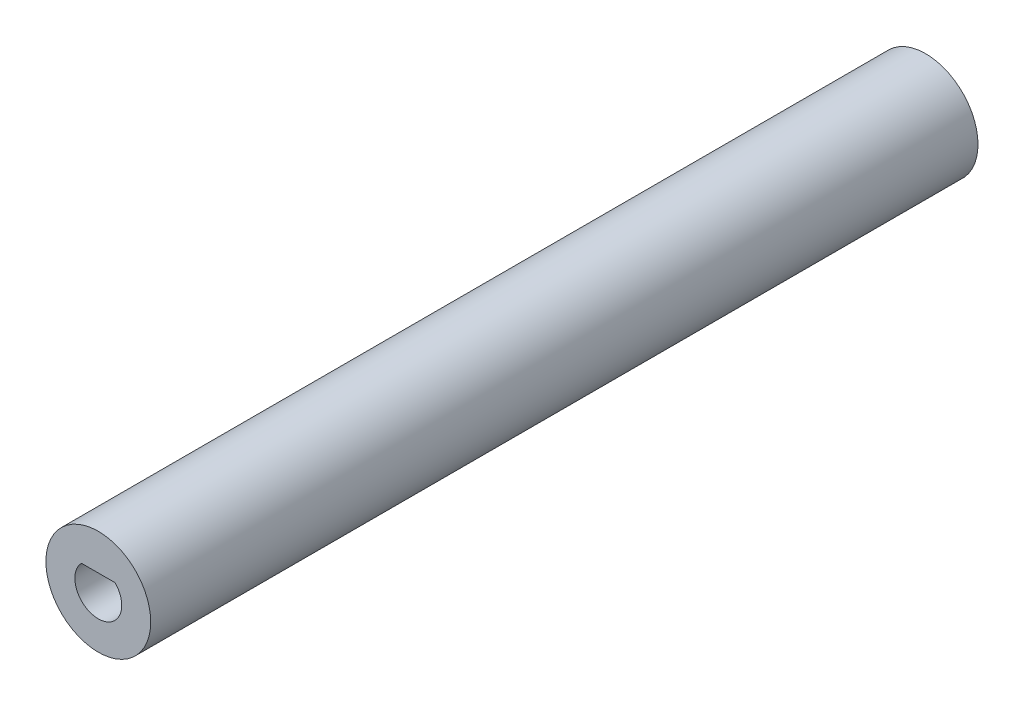
ISO-10303-21;
HEADER;
FILE_DESCRIPTION(('STEP AP214'),'2;1');
FILE_NAME('part.step','',(''),(''),'','','');
FILE_SCHEMA(('AUTOMOTIVE_DESIGN { 1 0 10303 214 1 1 1 1 }'));
ENDSEC;
DATA;
#1=APPLICATION_CONTEXT('core data for automotive mechanical design processes');
#2=APPLICATION_PROTOCOL_DEFINITION('international standard','automotive_design',2000,#1);
#3=PRODUCT_CONTEXT('',#1,'mechanical');
#4=PRODUCT('Part','Part','',(#3));
#5=PRODUCT_RELATED_PRODUCT_CATEGORY('part','',(#4));
#6=PRODUCT_DEFINITION_FORMATION('','',#4);
#7=PRODUCT_DEFINITION_CONTEXT('part definition',#1,'design');
#8=PRODUCT_DEFINITION('design','',#6,#7);
#9=PRODUCT_DEFINITION_SHAPE('','',#8);
#10=(LENGTH_UNIT() NAMED_UNIT(*) SI_UNIT(.MILLI.,.METRE.));
#11=(NAMED_UNIT(*) PLANE_ANGLE_UNIT() SI_UNIT($,.RADIAN.));
#12=(NAMED_UNIT(*) SI_UNIT($,.STERADIAN.) SOLID_ANGLE_UNIT());
#13=UNCERTAINTY_MEASURE_WITH_UNIT(LENGTH_MEASURE(1.E-05),#10,'distance_accuracy_value','');
#14=(GEOMETRIC_REPRESENTATION_CONTEXT(3) GLOBAL_UNCERTAINTY_ASSIGNED_CONTEXT((#13)) GLOBAL_UNIT_ASSIGNED_CONTEXT((#10,
#11,#12)) REPRESENTATION_CONTEXT('',''));
#15=CARTESIAN_POINT('',(0.,0.,0.));
#16=DIRECTION('',(0.,0.,1.));
#17=DIRECTION('',(1.,0.,0.));
#18=AXIS2_PLACEMENT_3D('',#15,#16,#17);
#19=CARTESIAN_POINT('',(0.,0.,75.));
#20=DIRECTION('',(0.,0.,-1.));
#21=DIRECTION('',(-1.,0.,0.));
#22=AXIS2_PLACEMENT_3D('',#19,#20,#21);
#23=CYLINDRICAL_SURFACE('',#22,4.75);
#24=CARTESIAN_POINT('',(0.,0.,75.));
#25=DIRECTION('',(0.,0.,1.));
#26=DIRECTION('',(1.,0.,0.));
#27=AXIS2_PLACEMENT_3D('',#24,#25,#26);
#28=CIRCLE('',#27,4.75);
#29=CARTESIAN_POINT('',(4.75,0.,75.));
#30=VERTEX_POINT('',#29);
#31=EDGE_CURVE('E11',#30,#30,#28,.T.);
#32=ORIENTED_EDGE('',*,*,#31,.F.);
#33=EDGE_LOOP('',(#32));
#34=FACE_BOUND('',#33,.T.);
#35=CARTESIAN_POINT('',(0.,0.,0.));
#36=DIRECTION('',(0.,0.,1.));
#37=DIRECTION('',(1.,0.,0.));
#38=AXIS2_PLACEMENT_3D('',#35,#36,#37);
#39=CIRCLE('',#38,4.75);
#40=CARTESIAN_POINT('',(4.75,0.,0.));
#41=VERTEX_POINT('',#40);
#42=EDGE_CURVE('E46',#41,#41,#39,.T.);
#43=ORIENTED_EDGE('',*,*,#42,.T.);
#44=EDGE_LOOP('',(#43));
#45=FACE_BOUND('',#44,.T.);
#46=ADVANCED_FACE('F43',(#34,#45),#23,.T.);
#47=CARTESIAN_POINT('',(0.,0.,75.));
#48=DIRECTION('',(0.,0.,1.));
#49=DIRECTION('',(1.,0.,0.));
#50=AXIS2_PLACEMENT_3D('',#47,#48,#49);
#51=PLANE('',#50);
#52=CARTESIAN_POINT('',(0.,0.,75.));
#53=DIRECTION('',(0.,0.,1.));
#54=DIRECTION('',(1.,0.,0.));
#55=AXIS2_PLACEMENT_3D('',#52,#53,#54);
#56=CIRCLE('',#55,2.125);
#57=CARTESIAN_POINT('',(-1.52970585407784,1.475,75.));
#58=VERTEX_POINT('',#57);
#59=CARTESIAN_POINT('',(1.52970585407784,1.475,75.));
#60=VERTEX_POINT('',#59);
#61=EDGE_CURVE('E58',#58,#60,#56,.T.);
#62=ORIENTED_EDGE('',*,*,#61,.F.);
#63=DIRECTION('',(-1.,0.,0.));
#64=VECTOR('',#63,1.);
#65=CARTESIAN_POINT('',(-1.52970585407784,1.475,75.));
#66=LINE('',#65,#64);
#67=EDGE_CURVE('E78',#60,#58,#66,.T.);
#68=ORIENTED_EDGE('',*,*,#67,.F.);
#69=EDGE_LOOP('',(#62,#68));
#70=FACE_BOUND('',#69,.T.);
#71=ORIENTED_EDGE('',*,*,#31,.T.);
#72=EDGE_LOOP('',(#71));
#73=FACE_BOUND('',#72,.T.);
#74=ADVANCED_FACE('F83',(#70,#73),#51,.T.);
#75=CARTESIAN_POINT('',(0.,0.,0.));
#76=DIRECTION('',(0.,0.,1.));
#77=DIRECTION('',(1.,0.,0.));
#78=AXIS2_PLACEMENT_3D('',#75,#76,#77);
#79=PLANE('',#78);
#80=ORIENTED_EDGE('',*,*,#42,.F.);
#81=EDGE_LOOP('',(#80));
#82=FACE_BOUND('',#81,.T.);
#83=ADVANCED_FACE('F106',(#82),#79,.F.);
#84=CARTESIAN_POINT('',(0.,0.,65.));
#85=DIRECTION('',(0.,0.,1.));
#86=DIRECTION('',(1.,0.,0.));
#87=AXIS2_PLACEMENT_3D('',#84,#85,#86);
#88=CYLINDRICAL_SURFACE('',#87,2.125);
#89=ORIENTED_EDGE('',*,*,#61,.T.);
#90=DIRECTION('',(0.,0.,1.));
#91=VECTOR('',#90,1.);
#92=CARTESIAN_POINT('',(1.52970585407784,1.475,65.));
#93=LINE('',#92,#91);
#94=CARTESIAN_POINT('',(1.52970585407784,1.475,65.));
#95=VERTEX_POINT('',#94);
#96=EDGE_CURVE('E75',#95,#60,#93,.T.);
#97=ORIENTED_EDGE('',*,*,#96,.F.);
#98=CARTESIAN_POINT('',(0.,0.,65.));
#99=DIRECTION('',(0.,0.,1.));
#100=DIRECTION('',(1.,0.,0.));
#101=AXIS2_PLACEMENT_3D('',#98,#99,#100);
#102=CIRCLE('',#101,2.125);
#103=CARTESIAN_POINT('',(-1.52970585407784,1.475,65.));
#104=VERTEX_POINT('',#103);
#105=EDGE_CURVE('E72',#104,#95,#102,.T.);
#106=ORIENTED_EDGE('',*,*,#105,.F.);
#107=DIRECTION('',(0.,0.,1.));
#108=VECTOR('',#107,1.);
#109=CARTESIAN_POINT('',(-1.52970585407784,1.475,65.));
#110=LINE('',#109,#108);
#111=EDGE_CURVE('E66',#104,#58,#110,.T.);
#112=ORIENTED_EDGE('',*,*,#111,.T.);
#113=EDGE_LOOP('',(#89,#97,#106,#112));
#114=FACE_BOUND('',#113,.T.);
#115=ADVANCED_FACE('F70',(#114),#88,.F.);
#116=CARTESIAN_POINT('',(-1.52970585407784,1.475,65.));
#117=DIRECTION('',(0.,1.,0.));
#118=DIRECTION('',(0.,0.,1.));
#119=AXIS2_PLACEMENT_3D('',#116,#117,#118);
#120=PLANE('',#119);
#121=ORIENTED_EDGE('',*,*,#67,.T.);
#122=ORIENTED_EDGE('',*,*,#111,.F.);
#123=DIRECTION('',(-1.,0.,0.));
#124=VECTOR('',#123,1.);
#125=CARTESIAN_POINT('',(-1.52970585407784,1.475,65.));
#126=LINE('',#125,#124);
#127=EDGE_CURVE('E89',#95,#104,#126,.T.);
#128=ORIENTED_EDGE('',*,*,#127,.F.);
#129=ORIENTED_EDGE('',*,*,#96,.T.);
#130=EDGE_LOOP('',(#121,#122,#128,#129));
#131=FACE_BOUND('',#130,.T.);
#132=ADVANCED_FACE('F79',(#131),#120,.F.);
#133=CARTESIAN_POINT('',(0.,0.,65.));
#134=DIRECTION('',(0.,0.,1.));
#135=DIRECTION('',(1.,0.,0.));
#136=AXIS2_PLACEMENT_3D('',#133,#134,#135);
#137=PLANE('',#136);
#138=ORIENTED_EDGE('',*,*,#105,.T.);
#139=ORIENTED_EDGE('',*,*,#127,.T.);
#140=EDGE_LOOP('',(#138,#139));
#141=FACE_BOUND('',#140,.T.);
#142=ADVANCED_FACE('F96',(#141),#137,.T.);
#143=CLOSED_SHELL('',(#46,#74,#83,#115,#132,#142));
#144=MANIFOLD_SOLID_BREP('B2',#143);
#145=ADVANCED_BREP_SHAPE_REPRESENTATION('',(#18,#144),#14);
#146=SHAPE_DEFINITION_REPRESENTATION(#9,#145);
ENDSEC;
END-ISO-10303-21;
